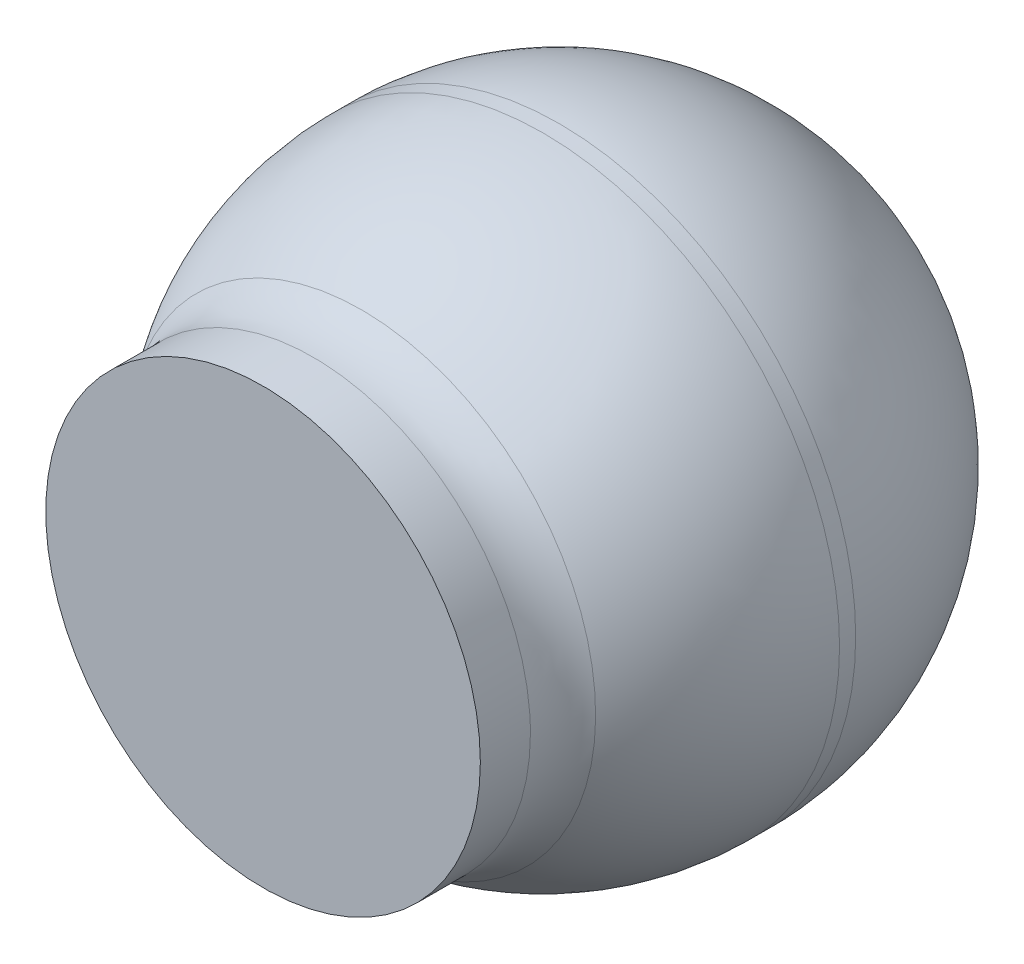
ISO-10303-21;
HEADER;
FILE_DESCRIPTION(('STEP AP214'),'2;1');
FILE_NAME('part.step','',(''),(''),'','','');
FILE_SCHEMA(('AUTOMOTIVE_DESIGN { 1 0 10303 214 1 1 1 1 }'));
ENDSEC;
DATA;
#1=APPLICATION_CONTEXT('core data for automotive mechanical design processes');
#2=APPLICATION_PROTOCOL_DEFINITION('international standard','automotive_design',2000,#1);
#3=PRODUCT_CONTEXT('',#1,'mechanical');
#4=PRODUCT('Part','Part','',(#3));
#5=PRODUCT_RELATED_PRODUCT_CATEGORY('part','',(#4));
#6=PRODUCT_DEFINITION_FORMATION('','',#4);
#7=PRODUCT_DEFINITION_CONTEXT('part definition',#1,'design');
#8=PRODUCT_DEFINITION('design','',#6,#7);
#9=PRODUCT_DEFINITION_SHAPE('','',#8);
#10=(LENGTH_UNIT() NAMED_UNIT(*) SI_UNIT(.MILLI.,.METRE.));
#11=(NAMED_UNIT(*) PLANE_ANGLE_UNIT() SI_UNIT($,.RADIAN.));
#12=(NAMED_UNIT(*) SI_UNIT($,.STERADIAN.) SOLID_ANGLE_UNIT());
#13=UNCERTAINTY_MEASURE_WITH_UNIT(LENGTH_MEASURE(1.E-05),#10,'distance_accuracy_value','');
#14=(GEOMETRIC_REPRESENTATION_CONTEXT(3) GLOBAL_UNCERTAINTY_ASSIGNED_CONTEXT((#13)) GLOBAL_UNIT_ASSIGNED_CONTEXT((#10,
#11,#12)) REPRESENTATION_CONTEXT('',''));
#15=CARTESIAN_POINT('',(0.,0.,0.));
#16=DIRECTION('',(0.,0.,1.));
#17=DIRECTION('',(1.,0.,0.));
#18=AXIS2_PLACEMENT_3D('',#15,#16,#17);
#19=CARTESIAN_POINT('',(-0.562919922269,-10.40134929145,10.006534503384));
#20=DIRECTION('',(0.,0.,-1.));
#21=DIRECTION('',(-1.,0.,0.));
#22=AXIS2_PLACEMENT_3D('',#19,#20,#21);
#23=PLANE('',#22);
#24=CARTESIAN_POINT('',(-0.562919922269,-10.40134929145,10.006534503384));
#25=DIRECTION('',(0.,0.,1.));
#26=DIRECTION('',(1.,0.,0.));
#27=AXIS2_PLACEMENT_3D('',#24,#25,#26);
#28=CIRCLE('',#27,0.275);
#29=CARTESIAN_POINT('',(-0.287919922269,-10.40134929145,10.006534503384));
#30=VERTEX_POINT('',#29);
#31=EDGE_CURVE('E20',#30,#30,#28,.F.);
#32=ORIENTED_EDGE('',*,*,#31,.F.);
#33=EDGE_LOOP('',(#32));
#34=FACE_BOUND('',#33,.T.);
#35=ADVANCED_FACE('F17',(#34),#23,.F.);
#36=CARTESIAN_POINT('',(-0.562919922269,-10.40134929145,9.906534503384));
#37=DIRECTION('',(0.,0.,1.));
#38=DIRECTION('',(1.,0.,0.));
#39=AXIS2_PLACEMENT_3D('',#36,#37,#38);
#40=CYLINDRICAL_SURFACE('',#39,0.275);
#41=CARTESIAN_POINT('',(-0.562919922269,-10.40134929145,9.943180457728));
#42=DIRECTION('',(0.,0.,-1.));
#43=DIRECTION('',(0.996700902337582,0.081162252799247,0.));
#44=AXIS2_PLACEMENT_3D('',#41,#42,#43);
#45=CIRCLE('',#44,0.275);
#46=CARTESIAN_POINT('',(-0.288827174126165,-10.3790296719302,9.943180457728));
#47=VERTEX_POINT('',#46);
#48=EDGE_CURVE('E66',#47,#47,#45,.F.);
#49=ORIENTED_EDGE('',*,*,#48,.T.);
#50=EDGE_LOOP('',(#49));
#51=FACE_BOUND('',#50,.T.);
#52=ORIENTED_EDGE('',*,*,#31,.T.);
#53=EDGE_LOOP('',(#52));
#54=FACE_BOUND('',#53,.T.);
#55=ADVANCED_FACE('F62',(#51,#54),#40,.T.);
#56=CARTESIAN_POINT('',(-0.562919922269,-10.40134929145,9.943180457728));
#57=DIRECTION('',(0.,0.,-1.));
#58=DIRECTION('',(0.996700902337583,0.0811622527992449,0.));
#59=AXIS2_PLACEMENT_3D('',#56,#57,#58);
#60=TOROIDAL_SURFACE('',#59,0.375,0.1);
#61=ORIENTED_EDGE('',*,*,#48,.F.);
#62=EDGE_LOOP('',(#61));
#63=FACE_BOUND('',#62,.T.);
#64=CARTESIAN_POINT('',(-0.562919922268999,-10.40134929145,9.881744931236));
#65=DIRECTION('',(0.,0.,-1.));
#66=DIRECTION('',(-0.99670090233869,-0.0811622527856412,0.));
#67=AXIS2_PLACEMENT_3D('',#64,#65,#66);
#68=CIRCLE('',#67,0.29609704641234);
#69=CARTESIAN_POINT('',(-0.858040115608,-10.42538119478,9.881744931236));
#70=VERTEX_POINT('',#69);
#71=EDGE_CURVE('E39',#70,#70,#68,.T.);
#72=ORIENTED_EDGE('',*,*,#71,.F.);
#73=EDGE_LOOP('',(#72));
#74=FACE_BOUND('',#73,.T.);
#75=ADVANCED_FACE('F57',(#63,#74),#60,.F.);
#76=CARTESIAN_POINT('',(-0.936682760645,-10.43178513625,9.651976062157));
#77=CARTESIAN_POINT('',(-0.936682760645,-10.43178513625,9.701461392103));
#78=CARTESIAN_POINT('',(-0.928526217348,-10.43112094157,9.750947004335));
#79=CARTESIAN_POINT('',(-0.912207085349,-10.42979205995,9.798626332798));
#80=CARTESIAN_POINT('',(-0.888341390838,-10.42784865493,9.842699544317));
#81=CARTESIAN_POINT('',(-0.858040115608,-10.42538119478,9.881744931236));
#82=(BOUNDED_CURVE() B_SPLINE_CURVE(5,(#76,#77,#78,#79,#80,#81),.UNSPECIFIED.,.F.,
.F.) B_SPLINE_CURVE_WITH_KNOTS((6,6),(0.,0.661568582165),
.UNSPECIFIED.) CURVE() GEOMETRIC_REPRESENTATION_ITEM() RATIONAL_B_SPLINE_CURVE((1.,1.,1.,1.,1.,1.)) REPRESENTATION_ITEM(''));
#83=CARTESIAN_POINT('',(-0.562919922269,-10.40134929145,9.651976062157));
#84=DIRECTION('',(0.,0.,-1.));
#85=AXIS1_PLACEMENT('',#83,#84);
#86=SURFACE_OF_REVOLUTION('',#82,#85);
#87=CARTESIAN_POINT('',(-0.562919922268999,-10.40134929145,9.651976062157));
#88=DIRECTION('',(0.,0.,1.));
#89=DIRECTION('',(1.,0.,0.));
#90=AXIS2_PLACEMENT_3D('',#87,#88,#89);
#91=CIRCLE('',#90,0.375);
#92=CARTESIAN_POINT('',(-0.187919922268999,-10.40134929145,9.651976062157));
#93=VERTEX_POINT('',#92);
#94=EDGE_CURVE('E36',#93,#93,#91,.F.);
#95=ORIENTED_EDGE('',*,*,#94,.F.);
#96=EDGE_LOOP('',(#95));
#97=FACE_BOUND('',#96,.T.);
#98=ORIENTED_EDGE('',*,*,#71,.T.);
#99=EDGE_LOOP('',(#98));
#100=FACE_BOUND('',#99,.T.);
#101=ADVANCED_FACE('F53',(#97,#100),#86,.F.);
#102=CARTESIAN_POINT('',(-0.562919922269,-10.40134929145,9.256534503384));
#103=DIRECTION('',(0.,0.,1.));
#104=DIRECTION('',(1.,0.,0.));
#105=AXIS2_PLACEMENT_3D('',#102,#103,#104);
#106=CYLINDRICAL_SURFACE('',#105,0.375);
#107=CARTESIAN_POINT('',(-0.562919922269,-10.40134929145,9.631534503384));
#108=DIRECTION('',(0.,0.,-1.));
#109=DIRECTION('',(0.0811622527992362,-0.996700902337583,0.));
#110=AXIS2_PLACEMENT_3D('',#107,#108,#109);
#111=CIRCLE('',#110,0.375);
#112=CARTESIAN_POINT('',(-0.532484077469287,-10.7751121298266,9.631534503384));
#113=VERTEX_POINT('',#112);
#114=CARTESIAN_POINT('',(-0.593355767068713,-10.0275864530734,9.631534503384));
#115=VERTEX_POINT('',#114);
#116=EDGE_CURVE('E11',#113,#115,#111,.T.);
#117=ORIENTED_EDGE('',*,*,#116,.F.);
#118=CARTESIAN_POINT('',(-0.562919922269,-10.40134929145,9.631534503384));
#119=DIRECTION('',(3.33436315446763E-12,2.72100352061447E-13,1.));
#120=DIRECTION('',(0.0811622527992359,-0.996700902337583,0.));
#121=AXIS2_PLACEMENT_3D('',#118,#119,#120);
#122=CIRCLE('',#121,0.375);
#123=EDGE_CURVE('E25',#115,#113,#122,.F.);
#124=ORIENTED_EDGE('',*,*,#123,.F.);
#125=EDGE_LOOP('',(#117,#124));
#126=FACE_BOUND('',#125,.T.);
#127=ORIENTED_EDGE('',*,*,#94,.T.);
#128=EDGE_LOOP('',(#127));
#129=FACE_BOUND('',#128,.T.);
#130=ADVANCED_FACE('F34',(#126,#129),#106,.T.);
#131=CARTESIAN_POINT('',(-0.562919922269,-10.40134929145,9.631534503384));
#132=DIRECTION('',(0.0811622527992361,-0.996700902337583,0.));
#133=DIRECTION('',(-0.996700902337583,-0.0811622527992361,0.));
#134=AXIS2_PLACEMENT_3D('',#131,#132,#133);
#135=SPHERICAL_SURFACE('',#134,0.375);
#136=ORIENTED_EDGE('',*,*,#123,.T.);
#137=ORIENTED_EDGE('',*,*,#116,.T.);
#138=EDGE_LOOP('',(#136,#137));
#139=FACE_BOUND('',#138,.T.);
#140=ADVANCED_FACE('F32',(#139),#135,.T.);
#141=CLOSED_SHELL('',(#35,#55,#75,#101,#130,#140));
#142=MANIFOLD_SOLID_BREP('B1',#141);
#143=ADVANCED_BREP_SHAPE_REPRESENTATION('',(#18,#142),#14);
#144=SHAPE_DEFINITION_REPRESENTATION(#9,#143);
ENDSEC;
END-ISO-10303-21;
